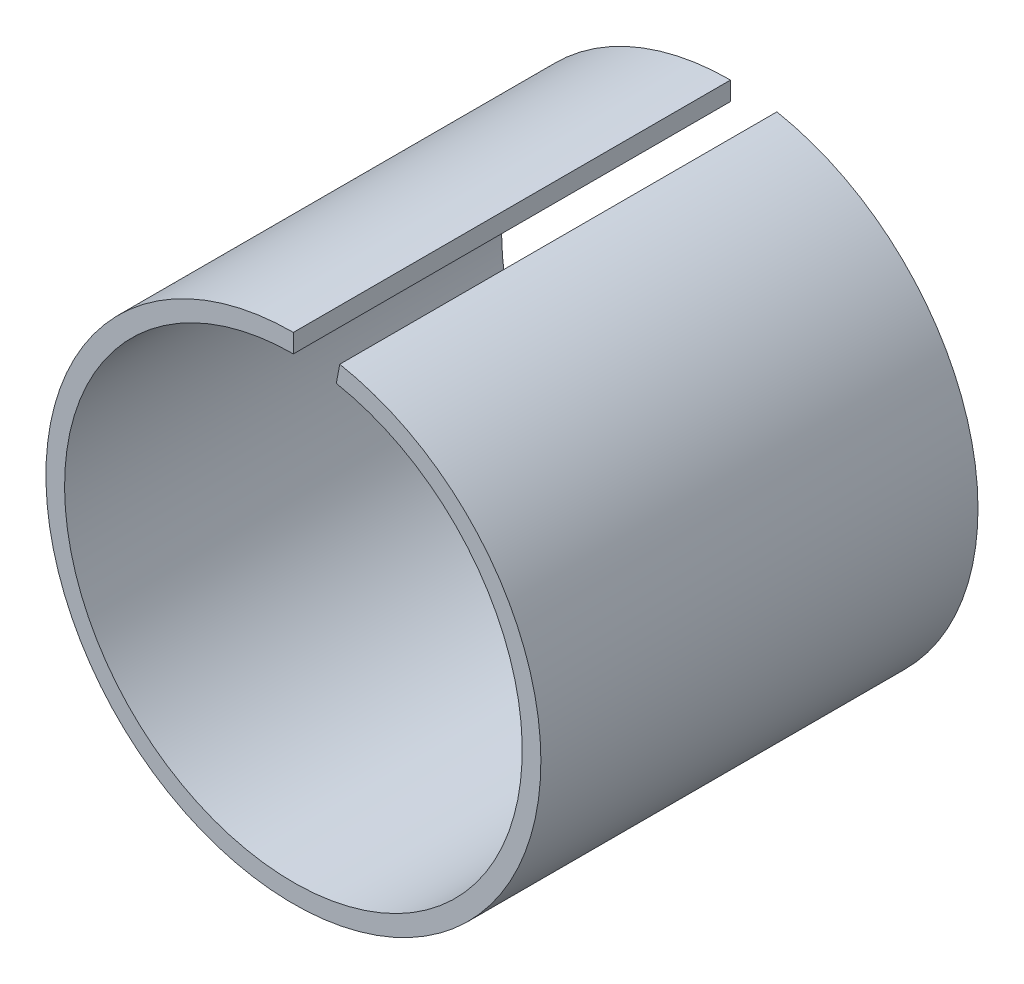
ISO-10303-21;
HEADER;
FILE_DESCRIPTION(('STEP AP214'),'2;1');
FILE_NAME('part.step','',(''),(''),'','','');
FILE_SCHEMA(('AUTOMOTIVE_DESIGN { 1 0 10303 214 1 1 1 1 }'));
ENDSEC;
DATA;
#1=APPLICATION_CONTEXT('core data for automotive mechanical design processes');
#2=APPLICATION_PROTOCOL_DEFINITION('international standard','automotive_design',2000,#1);
#3=PRODUCT_CONTEXT('',#1,'mechanical');
#4=PRODUCT('Part','Part','',(#3));
#5=PRODUCT_RELATED_PRODUCT_CATEGORY('part','',(#4));
#6=PRODUCT_DEFINITION_FORMATION('','',#4);
#7=PRODUCT_DEFINITION_CONTEXT('part definition',#1,'design');
#8=PRODUCT_DEFINITION('design','',#6,#7);
#9=PRODUCT_DEFINITION_SHAPE('','',#8);
#10=(LENGTH_UNIT() NAMED_UNIT(*) SI_UNIT(.MILLI.,.METRE.));
#11=(NAMED_UNIT(*) PLANE_ANGLE_UNIT() SI_UNIT($,.RADIAN.));
#12=(NAMED_UNIT(*) SI_UNIT($,.STERADIAN.) SOLID_ANGLE_UNIT());
#13=UNCERTAINTY_MEASURE_WITH_UNIT(LENGTH_MEASURE(1.E-05),#10,'distance_accuracy_value','');
#14=(GEOMETRIC_REPRESENTATION_CONTEXT(3) GLOBAL_UNCERTAINTY_ASSIGNED_CONTEXT((#13)) GLOBAL_UNIT_ASSIGNED_CONTEXT((#10,
#11,#12)) REPRESENTATION_CONTEXT('',''));
#15=CARTESIAN_POINT('',(0.,0.,0.));
#16=DIRECTION('',(0.,0.,1.));
#17=DIRECTION('',(1.,0.,0.));
#18=AXIS2_PLACEMENT_3D('',#15,#16,#17);
#19=CARTESIAN_POINT('',(0.,0.,-42.));
#20=DIRECTION('',(0.,0.,1.));
#21=DIRECTION('',(1.,0.,0.));
#22=AXIS2_PLACEMENT_3D('',#19,#20,#21);
#23=PLANE('',#22);
#24=DIRECTION('',(0.187367126858958,0.982289957076127,0.));
#25=VECTOR('',#24,1.);
#26=CARTESIAN_POINT('',(1.66756742904474,8.74238061797753,-42.));
#27=LINE('',#26,#25);
#28=CARTESIAN_POINT('',(3.33513485808947,17.4847612359551,-42.));
#29=VERTEX_POINT('',#28);
#30=CARTESIAN_POINT('',(3.60681719203495,18.9090816737154,-42.));
#31=VERTEX_POINT('',#30);
#32=EDGE_CURVE('E11',#29,#31,#27,.T.);
#33=ORIENTED_EDGE('',*,*,#32,.T.);
#34=CARTESIAN_POINT('',(0.,0.,-42.));
#35=DIRECTION('',(0.,0.,-1.));
#36=DIRECTION('',(0.,1.,0.));
#37=AXIS2_PLACEMENT_3D('',#34,#35,#36);
#38=CIRCLE('',#37,19.25);
#39=CARTESIAN_POINT('',(0.,19.25,-42.));
#40=VERTEX_POINT('',#39);
#41=EDGE_CURVE('E80',#31,#40,#38,.T.);
#42=ORIENTED_EDGE('',*,*,#41,.T.);
#43=DIRECTION('',(0.,-1.,0.));
#44=VECTOR('',#43,1.);
#45=CARTESIAN_POINT('',(0.,9.625,-42.));
#46=LINE('',#45,#44);
#47=CARTESIAN_POINT('',(0.,17.8,-42.));
#48=VERTEX_POINT('',#47);
#49=EDGE_CURVE('E87',#40,#48,#46,.T.);
#50=ORIENTED_EDGE('',*,*,#49,.T.);
#51=CARTESIAN_POINT('',(0.,0.,-42.));
#52=DIRECTION('',(0.,0.,1.));
#53=DIRECTION('',(1.,0.,0.));
#54=AXIS2_PLACEMENT_3D('',#51,#52,#53);
#55=CIRCLE('',#54,17.8);
#56=EDGE_CURVE('E102',#48,#29,#55,.T.);
#57=ORIENTED_EDGE('',*,*,#56,.T.);
#58=EDGE_LOOP('',(#33,#42,#50,#57));
#59=FACE_BOUND('',#58,.T.);
#60=ADVANCED_FACE('F17',(#59),#23,.F.);
#61=CARTESIAN_POINT('',(0.,0.,-8.));
#62=DIRECTION('',(0.,0.,1.));
#63=DIRECTION('',(1.,0.,0.));
#64=AXIS2_PLACEMENT_3D('',#61,#62,#63);
#65=PLANE('',#64);
#66=DIRECTION('',(0.187367126858958,0.982289957076127,0.));
#67=VECTOR('',#66,1.);
#68=CARTESIAN_POINT('',(1.66756742904474,8.74238061797753,-8.));
#69=LINE('',#68,#67);
#70=CARTESIAN_POINT('',(3.33513485808947,17.4847612359551,-8.));
#71=VERTEX_POINT('',#70);
#72=CARTESIAN_POINT('',(3.60681719203495,18.9090816737154,-8.));
#73=VERTEX_POINT('',#72);
#74=EDGE_CURVE('E26',#71,#73,#69,.T.);
#75=ORIENTED_EDGE('',*,*,#74,.F.);
#76=CARTESIAN_POINT('',(0.,0.,-8.));
#77=DIRECTION('',(0.,0.,1.));
#78=DIRECTION('',(1.,0.,0.));
#79=AXIS2_PLACEMENT_3D('',#76,#77,#78);
#80=CIRCLE('',#79,17.8);
#81=CARTESIAN_POINT('',(0.,17.8,-8.));
#82=VERTEX_POINT('',#81);
#83=EDGE_CURVE('E93',#82,#71,#80,.T.);
#84=ORIENTED_EDGE('',*,*,#83,.F.);
#85=DIRECTION('',(0.,-1.,0.));
#86=VECTOR('',#85,1.);
#87=CARTESIAN_POINT('',(0.,9.625,-8.));
#88=LINE('',#87,#86);
#89=CARTESIAN_POINT('',(0.,19.25,-8.));
#90=VERTEX_POINT('',#89);
#91=EDGE_CURVE('E85',#90,#82,#88,.T.);
#92=ORIENTED_EDGE('',*,*,#91,.F.);
#93=CARTESIAN_POINT('',(0.,0.,-8.));
#94=DIRECTION('',(0.,0.,-1.));
#95=DIRECTION('',(0.,1.,0.));
#96=AXIS2_PLACEMENT_3D('',#93,#94,#95);
#97=CIRCLE('',#96,19.25);
#98=EDGE_CURVE('E71',#73,#90,#97,.T.);
#99=ORIENTED_EDGE('',*,*,#98,.F.);
#100=EDGE_LOOP('',(#75,#84,#92,#99));
#101=FACE_BOUND('',#100,.T.);
#102=ADVANCED_FACE('F91',(#101),#65,.T.);
#103=CARTESIAN_POINT('',(3.33513485808947,17.4847612359551,-8.));
#104=DIRECTION('',(-0.982289957076127,0.187367126858958,0.));
#105=DIRECTION('',(0.,0.,1.));
#106=AXIS2_PLACEMENT_3D('',#103,#104,#105);
#107=PLANE('',#106);
#108=ORIENTED_EDGE('',*,*,#74,.T.);
#109=DIRECTION('',(0.,0.,-1.));
#110=VECTOR('',#109,1.);
#111=CARTESIAN_POINT('',(3.60681719203495,18.9090816737154,-8.));
#112=LINE('',#111,#110);
#113=EDGE_CURVE('E20',#73,#31,#112,.T.);
#114=ORIENTED_EDGE('',*,*,#113,.T.);
#115=ORIENTED_EDGE('',*,*,#32,.F.);
#116=DIRECTION('',(0.,0.,-1.));
#117=VECTOR('',#116,1.);
#118=CARTESIAN_POINT('',(3.33513485808947,17.4847612359551,-8.));
#119=LINE('',#118,#117);
#120=EDGE_CURVE('E115',#71,#29,#119,.T.);
#121=ORIENTED_EDGE('',*,*,#120,.F.);
#122=EDGE_LOOP('',(#108,#114,#115,#121));
#123=FACE_BOUND('',#122,.T.);
#124=ADVANCED_FACE('F136',(#123),#107,.T.);
#125=CARTESIAN_POINT('',(0.,0.,-8.));
#126=DIRECTION('',(0.,0.,-1.));
#127=DIRECTION('',(-0.0941011235955052,-0.99556264420581,0.));
#128=AXIS2_PLACEMENT_3D('',#125,#126,#127);
#129=CYLINDRICAL_SURFACE('',#128,19.25);
#130=ORIENTED_EDGE('',*,*,#98,.T.);
#131=DIRECTION('',(0.,0.,-1.));
#132=VECTOR('',#131,1.);
#133=CARTESIAN_POINT('',(0.,19.25,-8.));
#134=LINE('',#133,#132);
#135=EDGE_CURVE('E75',#90,#40,#134,.T.);
#136=ORIENTED_EDGE('',*,*,#135,.T.);
#137=ORIENTED_EDGE('',*,*,#41,.F.);
#138=ORIENTED_EDGE('',*,*,#113,.F.);
#139=EDGE_LOOP('',(#130,#136,#137,#138));
#140=FACE_BOUND('',#139,.T.);
#141=ADVANCED_FACE('F73',(#140),#129,.T.);
#142=CARTESIAN_POINT('',(0.,19.25,-8.));
#143=DIRECTION('',(1.,0.,0.));
#144=DIRECTION('',(0.,1.,0.));
#145=AXIS2_PLACEMENT_3D('',#142,#143,#144);
#146=PLANE('',#145);
#147=ORIENTED_EDGE('',*,*,#91,.T.);
#148=DIRECTION('',(0.,0.,-1.));
#149=VECTOR('',#148,1.);
#150=CARTESIAN_POINT('',(0.,17.8,-8.));
#151=LINE('',#150,#149);
#152=EDGE_CURVE('E95',#82,#48,#151,.T.);
#153=ORIENTED_EDGE('',*,*,#152,.T.);
#154=ORIENTED_EDGE('',*,*,#49,.F.);
#155=ORIENTED_EDGE('',*,*,#135,.F.);
#156=EDGE_LOOP('',(#147,#153,#154,#155));
#157=FACE_BOUND('',#156,.T.);
#158=ADVANCED_FACE('F83',(#157),#146,.T.);
#159=CARTESIAN_POINT('',(0.,0.,-8.));
#160=DIRECTION('',(0.,0.,-1.));
#161=DIRECTION('',(-0.0941011235955057,-0.99556264420581,0.));
#162=AXIS2_PLACEMENT_3D('',#159,#160,#161);
#163=CYLINDRICAL_SURFACE('',#162,17.8);
#164=ORIENTED_EDGE('',*,*,#83,.T.);
#165=ORIENTED_EDGE('',*,*,#120,.T.);
#166=ORIENTED_EDGE('',*,*,#56,.F.);
#167=ORIENTED_EDGE('',*,*,#152,.F.);
#168=EDGE_LOOP('',(#164,#165,#166,#167));
#169=FACE_BOUND('',#168,.T.);
#170=ADVANCED_FACE('F124',(#169),#163,.F.);
#171=CLOSED_SHELL('',(#60,#102,#124,#141,#158,#170));
#172=MANIFOLD_SOLID_BREP('B1',#171);
#173=ADVANCED_BREP_SHAPE_REPRESENTATION('',(#18,#172),#14);
#174=SHAPE_DEFINITION_REPRESENTATION(#9,#173);
ENDSEC;
END-ISO-10303-21;
